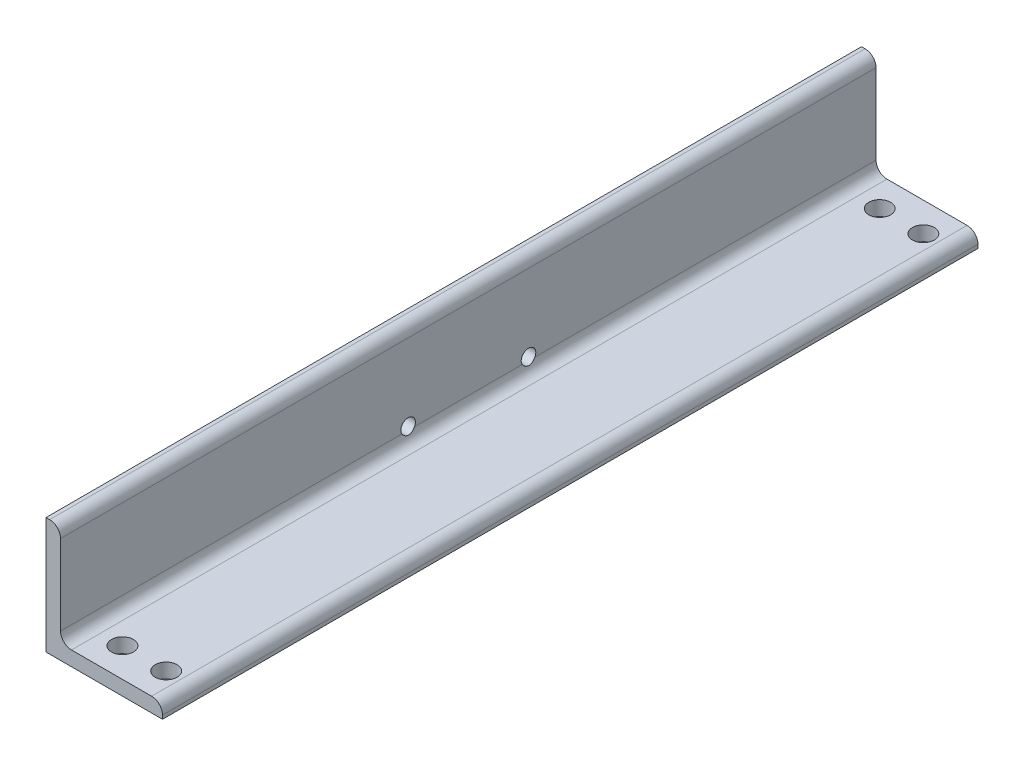
ISO-10303-21;
HEADER;
FILE_DESCRIPTION(('STEP AP214'),'2;1');
FILE_NAME('part.step','',(''),(''),'','','');
FILE_SCHEMA(('AUTOMOTIVE_DESIGN { 1 0 10303 214 1 1 1 1 }'));
ENDSEC;
DATA;
#1=APPLICATION_CONTEXT('core data for automotive mechanical design processes');
#2=APPLICATION_PROTOCOL_DEFINITION('international standard','automotive_design',2000,#1);
#3=PRODUCT_CONTEXT('',#1,'mechanical');
#4=PRODUCT('Part','Part','',(#3));
#5=PRODUCT_RELATED_PRODUCT_CATEGORY('part','',(#4));
#6=PRODUCT_DEFINITION_FORMATION('','',#4);
#7=PRODUCT_DEFINITION_CONTEXT('part definition',#1,'design');
#8=PRODUCT_DEFINITION('design','',#6,#7);
#9=PRODUCT_DEFINITION_SHAPE('','',#8);
#10=(LENGTH_UNIT() NAMED_UNIT(*) SI_UNIT(.MILLI.,.METRE.));
#11=(NAMED_UNIT(*) PLANE_ANGLE_UNIT() SI_UNIT($,.RADIAN.));
#12=(NAMED_UNIT(*) SI_UNIT($,.STERADIAN.) SOLID_ANGLE_UNIT());
#13=UNCERTAINTY_MEASURE_WITH_UNIT(LENGTH_MEASURE(1.E-05),#10,'distance_accuracy_value','');
#14=(GEOMETRIC_REPRESENTATION_CONTEXT(3) GLOBAL_UNCERTAINTY_ASSIGNED_CONTEXT((#13)) GLOBAL_UNIT_ASSIGNED_CONTEXT((#10,
#11,#12)) REPRESENTATION_CONTEXT('',''));
#15=CARTESIAN_POINT('',(0.,0.,0.));
#16=DIRECTION('',(0.,0.,1.));
#17=DIRECTION('',(1.,0.,0.));
#18=AXIS2_PLACEMENT_3D('',#15,#16,#17);
#19=CARTESIAN_POINT('',(101.6,0.,355.6));
#20=DIRECTION('',(0.,1.,0.));
#21=DIRECTION('',(-1.,0.,0.));
#22=AXIS2_PLACEMENT_3D('',#19,#20,#21);
#23=PLANE('',#22);
#24=CARTESIAN_POINT('',(79.3750000000002,0.,-330.2));
#25=DIRECTION('',(0.,1.,0.));
#26=DIRECTION('',(-1.,0.,0.));
#27=AXIS2_PLACEMENT_3D('',#24,#25,#26);
#28=CIRCLE('',#27,9.52500000000002);
#29=CARTESIAN_POINT('',(69.8500000000002,0.,-330.2));
#30=VERTEX_POINT('',#29);
#31=EDGE_CURVE('E211',#30,#30,#28,.F.);
#32=ORIENTED_EDGE('',*,*,#31,.F.);
#33=EDGE_LOOP('',(#32));
#34=FACE_BOUND('',#33,.T.);
#35=CARTESIAN_POINT('',(79.3750000000002,0.,330.2));
#36=DIRECTION('',(0.,1.,0.));
#37=DIRECTION('',(-1.,0.,0.));
#38=AXIS2_PLACEMENT_3D('',#35,#36,#37);
#39=CIRCLE('',#38,9.52500000000002);
#40=CARTESIAN_POINT('',(69.8500000000002,0.,330.2));
#41=VERTEX_POINT('',#40);
#42=EDGE_CURVE('E205',#41,#41,#39,.F.);
#43=ORIENTED_EDGE('',*,*,#42,.F.);
#44=EDGE_LOOP('',(#43));
#45=FACE_BOUND('',#44,.T.);
#46=CARTESIAN_POINT('',(41.275,0.,330.2));
#47=DIRECTION('',(0.,1.,0.));
#48=DIRECTION('',(-1.,0.,0.));
#49=AXIS2_PLACEMENT_3D('',#46,#47,#48);
#50=CIRCLE('',#49,9.52500000000002);
#51=CARTESIAN_POINT('',(31.75,0.,330.2));
#52=VERTEX_POINT('',#51);
#53=EDGE_CURVE('E199',#52,#52,#50,.F.);
#54=ORIENTED_EDGE('',*,*,#53,.F.);
#55=EDGE_LOOP('',(#54));
#56=FACE_BOUND('',#55,.T.);
#57=CARTESIAN_POINT('',(41.275,0.,-330.2));
#58=DIRECTION('',(0.,1.,0.));
#59=DIRECTION('',(-1.,0.,0.));
#60=AXIS2_PLACEMENT_3D('',#57,#58,#59);
#61=CIRCLE('',#60,9.52500000000002);
#62=CARTESIAN_POINT('',(31.75,0.,-330.2));
#63=VERTEX_POINT('',#62);
#64=EDGE_CURVE('E177',#63,#63,#61,.F.);
#65=ORIENTED_EDGE('',*,*,#64,.F.);
#66=EDGE_LOOP('',(#65));
#67=FACE_BOUND('',#66,.T.);
#68=DIRECTION('',(1.,0.,0.));
#69=VECTOR('',#68,1.);
#70=CARTESIAN_POINT('',(101.6,0.,-355.6));
#71=LINE('',#70,#69);
#72=CARTESIAN_POINT('',(0.,0.,-355.6));
#73=VERTEX_POINT('',#72);
#74=CARTESIAN_POINT('',(101.6,0.,-355.6));
#75=VERTEX_POINT('',#74);
#76=EDGE_CURVE('E174',#73,#75,#71,.T.);
#77=ORIENTED_EDGE('',*,*,#76,.T.);
#78=DIRECTION('',(0.,0.,-1.));
#79=VECTOR('',#78,1.);
#80=CARTESIAN_POINT('',(101.6,0.,355.6));
#81=LINE('',#80,#79);
#82=CARTESIAN_POINT('',(101.6,0.,355.6));
#83=VERTEX_POINT('',#82);
#84=EDGE_CURVE('E11',#83,#75,#81,.T.);
#85=ORIENTED_EDGE('',*,*,#84,.F.);
#86=DIRECTION('',(1.,0.,0.));
#87=VECTOR('',#86,1.);
#88=CARTESIAN_POINT('',(101.6,0.,355.6));
#89=LINE('',#88,#87);
#90=CARTESIAN_POINT('',(0.,0.,355.6));
#91=VERTEX_POINT('',#90);
#92=EDGE_CURVE('E159',#91,#83,#89,.T.);
#93=ORIENTED_EDGE('',*,*,#92,.F.);
#94=DIRECTION('',(0.,0.,-1.));
#95=VECTOR('',#94,1.);
#96=CARTESIAN_POINT('',(0.,0.,355.6));
#97=LINE('',#96,#95);
#98=EDGE_CURVE('E153',#91,#73,#97,.T.);
#99=ORIENTED_EDGE('',*,*,#98,.T.);
#100=EDGE_LOOP('',(#77,#85,#93,#99));
#101=FACE_BOUND('',#100,.T.);
#102=ADVANCED_FACE('F33',(#34,#45,#56,#67,#101),#23,.F.);
#103=CARTESIAN_POINT('',(101.6,3.18008,355.6));
#104=DIRECTION('',(-1.,0.,0.));
#105=DIRECTION('',(0.,0.,1.));
#106=AXIS2_PLACEMENT_3D('',#103,#104,#105);
#107=PLANE('',#106);
#108=DIRECTION('',(0.,1.,0.));
#109=VECTOR('',#108,1.);
#110=CARTESIAN_POINT('',(101.6,3.18008,-355.6));
#111=LINE('',#110,#109);
#112=CARTESIAN_POINT('',(101.6,3.18008,-355.6));
#113=VERTEX_POINT('',#112);
#114=EDGE_CURVE('E172',#75,#113,#111,.T.);
#115=ORIENTED_EDGE('',*,*,#114,.T.);
#116=DIRECTION('',(0.,0.,-1.));
#117=VECTOR('',#116,1.);
#118=CARTESIAN_POINT('',(101.6,3.18008,355.6));
#119=LINE('',#118,#117);
#120=CARTESIAN_POINT('',(101.6,3.18008,355.6));
#121=VERTEX_POINT('',#120);
#122=EDGE_CURVE('E40',#121,#113,#119,.T.);
#123=ORIENTED_EDGE('',*,*,#122,.F.);
#124=DIRECTION('',(0.,1.,0.));
#125=VECTOR('',#124,1.);
#126=CARTESIAN_POINT('',(101.6,3.18008,355.6));
#127=LINE('',#126,#125);
#128=EDGE_CURVE('E190',#83,#121,#127,.T.);
#129=ORIENTED_EDGE('',*,*,#128,.F.);
#130=ORIENTED_EDGE('',*,*,#84,.T.);
#131=EDGE_LOOP('',(#115,#123,#129,#130));
#132=FACE_BOUND('',#131,.T.);
#133=ADVANCED_FACE('F269',(#132),#107,.F.);
#134=CARTESIAN_POINT('',(92.08008,3.18008,355.6));
#135=DIRECTION('',(0.,0.,-1.));
#136=DIRECTION('',(-1.,0.,0.));
#137=AXIS2_PLACEMENT_3D('',#134,#135,#136);
#138=CYLINDRICAL_SURFACE('',#137,9.51991999999999);
#139=CARTESIAN_POINT('',(92.08008,3.18008,-355.6));
#140=DIRECTION('',(0.,0.,1.));
#141=DIRECTION('',(1.,0.,0.));
#142=AXIS2_PLACEMENT_3D('',#139,#140,#141);
#143=CIRCLE('',#142,9.51991999999999);
#144=CARTESIAN_POINT('',(92.08008,12.7,-355.6));
#145=VERTEX_POINT('',#144);
#146=EDGE_CURVE('E170',#113,#145,#143,.T.);
#147=ORIENTED_EDGE('',*,*,#146,.T.);
#148=DIRECTION('',(0.,0.,-1.));
#149=VECTOR('',#148,1.);
#150=CARTESIAN_POINT('',(92.08008,12.7,355.6));
#151=LINE('',#150,#149);
#152=CARTESIAN_POINT('',(92.08008,12.7,355.6));
#153=VERTEX_POINT('',#152);
#154=EDGE_CURVE('E136',#153,#145,#151,.T.);
#155=ORIENTED_EDGE('',*,*,#154,.F.);
#156=CARTESIAN_POINT('',(92.08008,3.18008,355.6));
#157=DIRECTION('',(0.,0.,1.));
#158=DIRECTION('',(1.,0.,0.));
#159=AXIS2_PLACEMENT_3D('',#156,#157,#158);
#160=CIRCLE('',#159,9.51991999999999);
#161=EDGE_CURVE('E188',#121,#153,#160,.T.);
#162=ORIENTED_EDGE('',*,*,#161,.F.);
#163=ORIENTED_EDGE('',*,*,#122,.T.);
#164=EDGE_LOOP('',(#147,#155,#162,#163));
#165=FACE_BOUND('',#164,.T.);
#166=ADVANCED_FACE('F265',(#165),#138,.T.);
#167=CARTESIAN_POINT('',(22.225,12.7,355.6));
#168=DIRECTION('',(0.,-1.,0.));
#169=DIRECTION('',(1.,0.,0.));
#170=AXIS2_PLACEMENT_3D('',#167,#168,#169);
#171=PLANE('',#170);
#172=CARTESIAN_POINT('',(79.3750000000002,12.7,-330.2));
#173=DIRECTION('',(0.,1.,0.));
#174=DIRECTION('',(1.,0.,0.));
#175=AXIS2_PLACEMENT_3D('',#172,#173,#174);
#176=CIRCLE('',#175,9.52500000000002);
#177=CARTESIAN_POINT('',(88.9000000000002,12.7,-330.2));
#178=VERTEX_POINT('',#177);
#179=EDGE_CURVE('E214',#178,#178,#176,.T.);
#180=ORIENTED_EDGE('',*,*,#179,.F.);
#181=EDGE_LOOP('',(#180));
#182=FACE_BOUND('',#181,.T.);
#183=CARTESIAN_POINT('',(79.3750000000002,12.7,330.2));
#184=DIRECTION('',(0.,1.,0.));
#185=DIRECTION('',(-1.,0.,0.));
#186=AXIS2_PLACEMENT_3D('',#183,#184,#185);
#187=CIRCLE('',#186,9.52500000000002);
#188=CARTESIAN_POINT('',(69.8500000000002,12.7,330.2));
#189=VERTEX_POINT('',#188);
#190=EDGE_CURVE('E208',#189,#189,#187,.T.);
#191=ORIENTED_EDGE('',*,*,#190,.F.);
#192=EDGE_LOOP('',(#191));
#193=FACE_BOUND('',#192,.T.);
#194=CARTESIAN_POINT('',(41.275,12.7,330.2));
#195=DIRECTION('',(0.,1.,0.));
#196=DIRECTION('',(1.,0.,0.));
#197=AXIS2_PLACEMENT_3D('',#194,#195,#196);
#198=CIRCLE('',#197,9.52500000000002);
#199=CARTESIAN_POINT('',(50.8,12.7,330.2));
#200=VERTEX_POINT('',#199);
#201=EDGE_CURVE('E202',#200,#200,#198,.T.);
#202=ORIENTED_EDGE('',*,*,#201,.F.);
#203=EDGE_LOOP('',(#202));
#204=FACE_BOUND('',#203,.T.);
#205=CARTESIAN_POINT('',(41.275,12.7,-330.2));
#206=DIRECTION('',(0.,1.,0.));
#207=DIRECTION('',(-1.,0.,0.));
#208=AXIS2_PLACEMENT_3D('',#205,#206,#207);
#209=CIRCLE('',#208,9.52500000000002);
#210=CARTESIAN_POINT('',(31.75,12.7,-330.2));
#211=VERTEX_POINT('',#210);
#212=EDGE_CURVE('E196',#211,#211,#209,.T.);
#213=ORIENTED_EDGE('',*,*,#212,.F.);
#214=EDGE_LOOP('',(#213));
#215=FACE_BOUND('',#214,.T.);
#216=DIRECTION('',(-1.,0.,0.));
#217=VECTOR('',#216,1.);
#218=CARTESIAN_POINT('',(22.225,12.7,-355.6));
#219=LINE('',#218,#217);
#220=CARTESIAN_POINT('',(22.225,12.7,-355.6));
#221=VERTEX_POINT('',#220);
#222=EDGE_CURVE('E168',#145,#221,#219,.T.);
#223=ORIENTED_EDGE('',*,*,#222,.T.);
#224=DIRECTION('',(0.,0.,-1.));
#225=VECTOR('',#224,1.);
#226=CARTESIAN_POINT('',(22.225,12.7,355.6));
#227=LINE('',#226,#225);
#228=CARTESIAN_POINT('',(22.225,12.7,355.6));
#229=VERTEX_POINT('',#228);
#230=EDGE_CURVE('E132',#229,#221,#227,.T.);
#231=ORIENTED_EDGE('',*,*,#230,.F.);
#232=DIRECTION('',(-1.,0.,0.));
#233=VECTOR('',#232,1.);
#234=CARTESIAN_POINT('',(22.225,12.7,355.6));
#235=LINE('',#234,#233);
#236=EDGE_CURVE('E186',#153,#229,#235,.T.);
#237=ORIENTED_EDGE('',*,*,#236,.F.);
#238=ORIENTED_EDGE('',*,*,#154,.T.);
#239=EDGE_LOOP('',(#223,#231,#237,#238));
#240=FACE_BOUND('',#239,.T.);
#241=ADVANCED_FACE('F261',(#182,#193,#204,#215,#240),#171,.F.);
#242=CARTESIAN_POINT('',(22.225,22.225,355.6));
#243=DIRECTION('',(0.,0.,-1.));
#244=DIRECTION('',(-1.,0.,0.));
#245=AXIS2_PLACEMENT_3D('',#242,#243,#244);
#246=CYLINDRICAL_SURFACE('',#245,9.525);
#247=DIRECTION('',(0.,0.,-1.));
#248=VECTOR('',#247,1.);
#249=CARTESIAN_POINT('',(12.7,22.225,355.6));
#250=LINE('',#249,#248);
#251=CARTESIAN_POINT('',(12.7,22.225,46.9898386859688));
#252=VERTEX_POINT('',#251);
#253=CARTESIAN_POINT('',(12.7,22.225,-46.9898386859688));
#254=VERTEX_POINT('',#253);
#255=EDGE_CURVE('E126',#252,#254,#250,.T.);
#256=ORIENTED_EDGE('',*,*,#255,.F.);
#257=CARTESIAN_POINT('',(12.7,22.225,57.9883613140312));
#258=CARTESIAN_POINT('',(12.6999827797198,22.073747023169,57.9010652201356));
#259=CARTESIAN_POINT('',(12.7036020266311,21.9261666695694,57.8075126623455));
#260=CARTESIAN_POINT('',(12.7169364482523,21.6394724254637,57.6087916880467));
#261=CARTESIAN_POINT('',(12.7266475791581,21.5003529857331,57.5036310151549));
#262=CARTESIAN_POINT('',(12.750958155591,21.2318706006449,57.2827790052491));
#263=CARTESIAN_POINT('',(12.7655439948094,21.1024817133119,57.1671176251949));
#264=CARTESIAN_POINT('',(12.798377928773,20.8538152379376,56.9258460242172));
#265=CARTESIAN_POINT('',(12.8166265898387,20.7345392175398,56.8002342666547));
#266=CARTESIAN_POINT('',(12.8554966806538,20.5070584428926,56.5401989781871));
#267=CARTESIAN_POINT('',(12.8761128381699,20.3988300647512,56.4057953030353));
#268=CARTESIAN_POINT('',(12.9185263814264,20.1937077958268,56.1287078060163));
#269=CARTESIAN_POINT('',(12.9403241689367,20.0968177960641,55.9860211666475));
#270=CARTESIAN_POINT('',(12.9839042072899,19.9149071167127,55.6931579148723));
#271=CARTESIAN_POINT('',(13.0056864428088,19.8298930504997,55.5429771918946));
#272=CARTESIAN_POINT('',(13.0480696077046,19.6723085952029,55.2360634666354));
#273=CARTESIAN_POINT('',(13.0686705459691,19.5997381124907,55.0793305136655));
#274=CARTESIAN_POINT('',(13.1084371762002,19.4647334353171,54.7534986760388));
#275=CARTESIAN_POINT('',(13.1275058271347,19.4028551354978,54.5841570080992));
#276=CARTESIAN_POINT('',(13.1621000716122,19.2936601731414,54.2405554814189));
#277=CARTESIAN_POINT('',(13.1776270141682,19.2463379638852,54.0662975237747));
#278=CARTESIAN_POINT('',(13.2042460989573,19.1666685130754,53.7141143642797));
#279=CARTESIAN_POINT('',(13.2153397547296,19.134316160165,53.5361904358563));
#280=CARTESIAN_POINT('',(13.2324460824723,19.0848905322721,53.1779933638632));
#281=CARTESIAN_POINT('',(13.2384590349304,19.0678164138286,52.9977203505364));
#282=CARTESIAN_POINT('',(13.2449047015103,19.0495315458891,52.6441047809365));
#283=CARTESIAN_POINT('',(13.2455676813632,19.0476661661744,52.4707999822138));
#284=CARTESIAN_POINT('',(13.2418817508243,19.0581020362111,52.1246741779014));
#285=CARTESIAN_POINT('',(13.2375329652902,19.0704029330389,51.9518531603668));
#286=CARTESIAN_POINT('',(13.2240617329295,19.1090488693273,51.6079804584642));
#287=CARTESIAN_POINT('',(13.2149392563347,19.1353939963659,51.4369287851363));
#288=CARTESIAN_POINT('',(13.1924145874921,19.2018799599007,51.097818829635));
#289=CARTESIAN_POINT('',(13.179012369901,19.2420208780908,50.9297605651938));
#290=CARTESIAN_POINT('',(13.1489414832537,19.3348245533895,50.6010485624637));
#291=CARTESIAN_POINT('',(13.1323423995837,19.3872249217998,50.4403141695282));
#292=CARTESIAN_POINT('',(13.09654646157,19.5045731325474,50.1237351278395));
#293=CARTESIAN_POINT('',(13.0773487466099,19.569525134804,49.9678921201718));
#294=CARTESIAN_POINT('',(13.0373033169677,19.7115759448712,49.6619466657816));
#295=CARTESIAN_POINT('',(13.0164545660346,19.7886824118256,49.5118479134289));
#296=CARTESIAN_POINT('',(12.9741618627834,19.9545503138604,49.218320601231));
#297=CARTESIAN_POINT('',(12.9527178920628,20.0433121096079,49.0748922479835));
#298=CARTESIAN_POINT('',(12.9091267176458,20.2373942526399,48.7875116740178));
#299=CARTESIAN_POINT('',(12.8870092961105,20.3433707692314,48.6439973630533));
#300=CARTESIAN_POINT('',(12.8446977357167,20.5671365603044,48.3662709902861));
#301=CARTESIAN_POINT('',(12.8245029073061,20.684921568229,48.2320555980954));
#302=CARTESIAN_POINT('',(12.7874276417262,20.9314165936433,47.9740092378239));
#303=CARTESIAN_POINT('',(12.770541517766,21.060107311767,47.8501606656117));
#304=CARTESIAN_POINT('',(12.7414041834692,21.3277095254071,47.613567490968));
#305=CARTESIAN_POINT('',(12.7291502409881,21.4666149381728,47.5008163721771));
#306=CARTESIAN_POINT('',(12.7134994081993,21.7085613726005,47.3208477880985));
#307=CARTESIAN_POINT('',(12.7085293033237,21.8091554322337,47.2504558963998));
#308=CARTESIAN_POINT('',(12.7017790449912,22.0142331751444,47.1156334058616));
#309=CARTESIAN_POINT('',(12.6999960275457,22.1187132800441,47.051197504272));
#310=CARTESIAN_POINT('',(12.7,22.225,46.9898386859688));
#311=B_SPLINE_CURVE_WITH_KNOTS('',3,(#257,#258,#259,#260,#261,#262,#263,#264,#265,#266,#267,
#268,#269,#270,#271,#272,#273,#274,#275,#276,#277,#278,#279,#280,#281,#282,#283,#284,#285,#286,
#287,#288,#289,#290,#291,#292,#293,#294,#295,#296,#297,#298,#299,#300,#301,#302,#303,#304,#305,
#306,#307,#308,#309,#310),.UNSPECIFIED.,.F.,.F.,(4,2,2,2,2,2,2,2,2,2,2,2,2,2,2,2,2,2,2,2,2,2,2,
2,2,2,4),(0.,0.523647527244092,1.04694782355641,1.56879951356916,2.09073195095308,
2.61152383605134,3.13249392175962,3.65375297441758,4.1750081048293,4.71822515052251,
5.26123494167947,5.80405918872552,6.34685346638262,6.86615386676676,7.38544133013571,
7.90473203175342,8.42402580848562,8.93308470454926,9.44231260546989,9.95186268900613,
10.4614285439838,11.0000966296267,11.5385707843629,12.0761111655917,12.6133339992296,
12.9817344318086,13.3498036447116),.UNSPECIFIED.);
#312=CARTESIAN_POINT('',(12.7,22.225,57.9883613140312));
#313=VERTEX_POINT('',#312);
#314=EDGE_CURVE('E46',#313,#252,#311,.T.);
#315=ORIENTED_EDGE('',*,*,#314,.F.);
#316=CARTESIAN_POINT('',(12.7,22.225,355.6));
#317=VERTEX_POINT('',#316);
#318=EDGE_CURVE('E124',#317,#313,#250,.T.);
#319=ORIENTED_EDGE('',*,*,#318,.F.);
#320=CARTESIAN_POINT('',(22.225,22.225,355.6));
#321=DIRECTION('',(0.,0.,-1.));
#322=DIRECTION('',(-1.,0.,0.));
#323=AXIS2_PLACEMENT_3D('',#320,#321,#322);
#324=CIRCLE('',#323,9.525);
#325=EDGE_CURVE('E184',#229,#317,#324,.T.);
#326=ORIENTED_EDGE('',*,*,#325,.F.);
#327=ORIENTED_EDGE('',*,*,#230,.T.);
#328=CARTESIAN_POINT('',(22.225,22.225,-355.6));
#329=DIRECTION('',(0.,0.,-1.));
#330=DIRECTION('',(-1.,0.,0.));
#331=AXIS2_PLACEMENT_3D('',#328,#329,#330);
#332=CIRCLE('',#331,9.525);
#333=CARTESIAN_POINT('',(12.7,22.225,-355.6));
#334=VERTEX_POINT('',#333);
#335=EDGE_CURVE('E166',#221,#334,#332,.T.);
#336=ORIENTED_EDGE('',*,*,#335,.T.);
#337=CARTESIAN_POINT('',(12.7,22.225,-57.9883613140312));
#338=VERTEX_POINT('',#337);
#339=EDGE_CURVE('E134',#338,#334,#250,.T.);
#340=ORIENTED_EDGE('',*,*,#339,.F.);
#341=CARTESIAN_POINT('',(12.7,22.225,-46.9898386859688));
#342=CARTESIAN_POINT('',(12.6999827797198,22.073747023169,-47.0771347798644));
#343=CARTESIAN_POINT('',(12.7036020266311,21.9261666695694,-47.1706873376545));
#344=CARTESIAN_POINT('',(12.7169364482523,21.6394724254637,-47.3694083119533));
#345=CARTESIAN_POINT('',(12.7266475791581,21.5003529857331,-47.4745689848451));
#346=CARTESIAN_POINT('',(12.750958155591,21.2318706006448,-47.6954209947508));
#347=CARTESIAN_POINT('',(12.7655439948094,21.1024817133119,-47.8110823748051));
#348=CARTESIAN_POINT('',(12.798377928773,20.8538152379376,-48.0523539757828));
#349=CARTESIAN_POINT('',(12.8166265898387,20.7345392175398,-48.1779657333453));
#350=CARTESIAN_POINT('',(12.8554966806538,20.5070584428925,-48.4380010218129));
#351=CARTESIAN_POINT('',(12.8761128381699,20.3988300647512,-48.5724046969646));
#352=CARTESIAN_POINT('',(12.9185263814264,20.1937077958268,-48.8494921939837));
#353=CARTESIAN_POINT('',(12.9403241689367,20.0968177960641,-48.9921788333524));
#354=CARTESIAN_POINT('',(12.9839042072899,19.9149071167127,-49.2850420851277));
#355=CARTESIAN_POINT('',(13.0056864428088,19.8298930504997,-49.4352228081054));
#356=CARTESIAN_POINT('',(13.0480696077046,19.6723085952029,-49.7421365333646));
#357=CARTESIAN_POINT('',(13.0686705459691,19.5997381124906,-49.8988694863345));
#358=CARTESIAN_POINT('',(13.1084371762002,19.4647334353171,-50.2247013239612));
#359=CARTESIAN_POINT('',(13.1275058271347,19.4028551354978,-50.3940429919008));
#360=CARTESIAN_POINT('',(13.1621000716123,19.2936601731414,-50.737644518581));
#361=CARTESIAN_POINT('',(13.1776270141682,19.2463379638851,-50.9119024762253));
#362=CARTESIAN_POINT('',(13.2042460989573,19.1666685130754,-51.2640856357203));
#363=CARTESIAN_POINT('',(13.2153397547297,19.134316160165,-51.4420095641437));
#364=CARTESIAN_POINT('',(13.2324460824723,19.0848905322721,-51.8002066361368));
#365=CARTESIAN_POINT('',(13.2384590349304,19.0678164138286,-51.9804796494636));
#366=CARTESIAN_POINT('',(13.2449047015103,19.0495315458891,-52.3340952190635));
#367=CARTESIAN_POINT('',(13.2455676813632,19.0476661661744,-52.5074000177862));
#368=CARTESIAN_POINT('',(13.2418817508243,19.0581020362111,-52.8535258220986));
#369=CARTESIAN_POINT('',(13.2375329652902,19.0704029330389,-53.0263468396332));
#370=CARTESIAN_POINT('',(13.2240617329295,19.1090488693273,-53.3702195415358));
#371=CARTESIAN_POINT('',(13.2149392563347,19.1353939963659,-53.5412712148637));
#372=CARTESIAN_POINT('',(13.1924145874921,19.2018799599007,-53.8803811703649));
#373=CARTESIAN_POINT('',(13.179012369901,19.2420208780907,-54.0484394348062));
#374=CARTESIAN_POINT('',(13.1489414832537,19.3348245533895,-54.3771514375363));
#375=CARTESIAN_POINT('',(13.1323423995837,19.3872249217998,-54.5378858304718));
#376=CARTESIAN_POINT('',(13.09654646157,19.5045731325473,-54.8544648721605));
#377=CARTESIAN_POINT('',(13.0773487466099,19.5695251348039,-55.0103078798282));
#378=CARTESIAN_POINT('',(13.0373033169677,19.7115759448712,-55.3162533342184));
#379=CARTESIAN_POINT('',(13.0164545660346,19.7886824118256,-55.4663520865711));
#380=CARTESIAN_POINT('',(12.9741618627834,19.9545503138604,-55.7598793987689));
#381=CARTESIAN_POINT('',(12.9527178920628,20.0433121096079,-55.9033077520165));
#382=CARTESIAN_POINT('',(12.9091267176458,20.2373942526399,-56.1906883259822));
#383=CARTESIAN_POINT('',(12.8870092961105,20.3433707692314,-56.3342026369467));
#384=CARTESIAN_POINT('',(12.8446977357167,20.5671365603044,-56.6119290097139));
#385=CARTESIAN_POINT('',(12.8245029073061,20.684921568229,-56.7461444019046));
#386=CARTESIAN_POINT('',(12.7874276417262,20.9314165936433,-57.0041907621761));
#387=CARTESIAN_POINT('',(12.770541517766,21.060107311767,-57.1280393343883));
#388=CARTESIAN_POINT('',(12.7414041834692,21.3277095254071,-57.364632509032));
#389=CARTESIAN_POINT('',(12.7291502409881,21.4666149381728,-57.4773836278229));
#390=CARTESIAN_POINT('',(12.7134994081993,21.7085613726005,-57.6573522119016));
#391=CARTESIAN_POINT('',(12.7085293033237,21.8091554322337,-57.7277441036002));
#392=CARTESIAN_POINT('',(12.7017790449912,22.0142331751444,-57.8625665941384));
#393=CARTESIAN_POINT('',(12.6999960275457,22.1187132800441,-57.927002495728));
#394=CARTESIAN_POINT('',(12.7,22.225,-57.9883613140312));
#395=B_SPLINE_CURVE_WITH_KNOTS('',3,(#341,#342,#343,#344,#345,#346,#347,#348,#349,#350,#351,
#352,#353,#354,#355,#356,#357,#358,#359,#360,#361,#362,#363,#364,#365,#366,#367,#368,#369,#370,
#371,#372,#373,#374,#375,#376,#377,#378,#379,#380,#381,#382,#383,#384,#385,#386,#387,#388,#389,
#390,#391,#392,#393,#394),.UNSPECIFIED.,.F.,.F.,(4,2,2,2,2,2,2,2,2,2,2,2,2,2,2,2,2,2,2,2,2,2,2,
2,2,2,4),(0.,0.523647527244094,1.04694782355641,1.56879951356915,2.09073195095308,
2.61152383605134,3.13249392175962,3.65375297441757,4.1750081048293,4.71822515052252,
5.26123494167948,5.80405918872553,6.34685346638263,6.86615386676677,7.38544133013572,
7.90473203175342,8.42402580848563,8.93308470454928,9.44231260546991,9.95186268900614,
10.4614285439838,11.0000966296267,11.5385707843629,12.0761111655918,12.6133339992296,
12.9817344318086,13.3498036447117),.UNSPECIFIED.);
#396=EDGE_CURVE('E53',#254,#338,#395,.T.);
#397=ORIENTED_EDGE('',*,*,#396,.F.);
#398=EDGE_LOOP('',(#256,#315,#319,#326,#327,#336,#340,#397));
#399=FACE_BOUND('',#398,.T.);
#400=ADVANCED_FACE('F122',(#399),#246,.F.);
#401=CARTESIAN_POINT('',(12.7,92.08008,355.6));
#402=DIRECTION('',(-1.,0.,0.));
#403=DIRECTION('',(0.,-1.,0.));
#404=AXIS2_PLACEMENT_3D('',#401,#402,#403);
#405=PLANE('',#404);
#406=ORIENTED_EDGE('',*,*,#318,.T.);
#407=CARTESIAN_POINT('',(12.7,25.4,52.4891));
#408=DIRECTION('',(-1.,0.,0.));
#409=DIRECTION('',(0.,-1.,0.));
#410=AXIS2_PLACEMENT_3D('',#407,#408,#409);
#411=CIRCLE('',#410,6.35);
#412=EDGE_CURVE('E113',#252,#313,#411,.F.);
#413=ORIENTED_EDGE('',*,*,#412,.F.);
#414=ORIENTED_EDGE('',*,*,#255,.T.);
#415=CARTESIAN_POINT('',(12.7,25.4,-52.4891));
#416=DIRECTION('',(-1.,0.,0.));
#417=DIRECTION('',(0.,-1.,0.));
#418=AXIS2_PLACEMENT_3D('',#415,#416,#417);
#419=CIRCLE('',#418,6.35);
#420=EDGE_CURVE('E223',#338,#254,#419,.F.);
#421=ORIENTED_EDGE('',*,*,#420,.F.);
#422=ORIENTED_EDGE('',*,*,#339,.T.);
#423=DIRECTION('',(0.,1.,0.));
#424=VECTOR('',#423,1.);
#425=CARTESIAN_POINT('',(12.7,92.08008,-355.6));
#426=LINE('',#425,#424);
#427=CARTESIAN_POINT('',(12.7,92.08008,-355.6));
#428=VERTEX_POINT('',#427);
#429=EDGE_CURVE('E164',#334,#428,#426,.T.);
#430=ORIENTED_EDGE('',*,*,#429,.T.);
#431=DIRECTION('',(0.,0.,-1.));
#432=VECTOR('',#431,1.);
#433=CARTESIAN_POINT('',(12.7,92.08008,355.6));
#434=LINE('',#433,#432);
#435=CARTESIAN_POINT('',(12.7,92.08008,355.6));
#436=VERTEX_POINT('',#435);
#437=EDGE_CURVE('E139',#436,#428,#434,.T.);
#438=ORIENTED_EDGE('',*,*,#437,.F.);
#439=DIRECTION('',(0.,1.,0.));
#440=VECTOR('',#439,1.);
#441=CARTESIAN_POINT('',(12.7,92.08008,355.6));
#442=LINE('',#441,#440);
#443=EDGE_CURVE('E131',#317,#436,#442,.T.);
#444=ORIENTED_EDGE('',*,*,#443,.F.);
#445=EDGE_LOOP('',(#406,#413,#414,#421,#422,#430,#438,#444));
#446=FACE_BOUND('',#445,.T.);
#447=ADVANCED_FACE('F129',(#446),#405,.F.);
#448=CARTESIAN_POINT('',(3.18008,92.08008,355.6));
#449=DIRECTION('',(0.,0.,-1.));
#450=DIRECTION('',(-1.,0.,0.));
#451=AXIS2_PLACEMENT_3D('',#448,#449,#450);
#452=CYLINDRICAL_SURFACE('',#451,9.51992);
#453=CARTESIAN_POINT('',(3.18008,92.08008,-355.6));
#454=DIRECTION('',(0.,0.,1.));
#455=DIRECTION('',(-1.,0.,0.));
#456=AXIS2_PLACEMENT_3D('',#453,#454,#455);
#457=CIRCLE('',#456,9.51992);
#458=CARTESIAN_POINT('',(3.18008,101.6,-355.6));
#459=VERTEX_POINT('',#458);
#460=EDGE_CURVE('E162',#428,#459,#457,.T.);
#461=ORIENTED_EDGE('',*,*,#460,.T.);
#462=DIRECTION('',(0.,0.,-1.));
#463=VECTOR('',#462,1.);
#464=CARTESIAN_POINT('',(3.18008,101.6,355.6));
#465=LINE('',#464,#463);
#466=CARTESIAN_POINT('',(3.18008,101.6,355.6));
#467=VERTEX_POINT('',#466);
#468=EDGE_CURVE('E143',#467,#459,#465,.T.);
#469=ORIENTED_EDGE('',*,*,#468,.F.);
#470=CARTESIAN_POINT('',(3.18008,92.08008,355.6));
#471=DIRECTION('',(0.,0.,1.));
#472=DIRECTION('',(-1.,0.,0.));
#473=AXIS2_PLACEMENT_3D('',#470,#471,#472);
#474=CIRCLE('',#473,9.51992);
#475=EDGE_CURVE('E181',#436,#467,#474,.T.);
#476=ORIENTED_EDGE('',*,*,#475,.F.);
#477=ORIENTED_EDGE('',*,*,#437,.T.);
#478=EDGE_LOOP('',(#461,#469,#476,#477));
#479=FACE_BOUND('',#478,.T.);
#480=ADVANCED_FACE('F251',(#479),#452,.T.);
#481=CARTESIAN_POINT('',(0.,101.6,355.6));
#482=DIRECTION('',(0.,-1.,0.));
#483=DIRECTION('',(0.,0.,-1.));
#484=AXIS2_PLACEMENT_3D('',#481,#482,#483);
#485=PLANE('',#484);
#486=DIRECTION('',(-1.,0.,0.));
#487=VECTOR('',#486,1.);
#488=CARTESIAN_POINT('',(0.,101.6,-355.6));
#489=LINE('',#488,#487);
#490=CARTESIAN_POINT('',(0.,101.6,-355.6));
#491=VERTEX_POINT('',#490);
#492=EDGE_CURVE('E160',#459,#491,#489,.T.);
#493=ORIENTED_EDGE('',*,*,#492,.T.);
#494=DIRECTION('',(0.,0.,-1.));
#495=VECTOR('',#494,1.);
#496=CARTESIAN_POINT('',(0.,101.6,355.6));
#497=LINE('',#496,#495);
#498=CARTESIAN_POINT('',(0.,101.6,355.6));
#499=VERTEX_POINT('',#498);
#500=EDGE_CURVE('E148',#499,#491,#497,.T.);
#501=ORIENTED_EDGE('',*,*,#500,.F.);
#502=DIRECTION('',(-1.,0.,0.));
#503=VECTOR('',#502,1.);
#504=CARTESIAN_POINT('',(0.,101.6,355.6));
#505=LINE('',#504,#503);
#506=EDGE_CURVE('E179',#467,#499,#505,.T.);
#507=ORIENTED_EDGE('',*,*,#506,.F.);
#508=ORIENTED_EDGE('',*,*,#468,.T.);
#509=EDGE_LOOP('',(#493,#501,#507,#508));
#510=FACE_BOUND('',#509,.T.);
#511=ADVANCED_FACE('F279',(#510),#485,.F.);
#512=CARTESIAN_POINT('',(0.,0.,355.6));
#513=DIRECTION('',(1.,0.,0.));
#514=DIRECTION('',(0.,0.,-1.));
#515=AXIS2_PLACEMENT_3D('',#512,#513,#514);
#516=PLANE('',#515);
#517=CARTESIAN_POINT('',(0.,25.4,52.4891));
#518=DIRECTION('',(-1.,0.,0.));
#519=DIRECTION('',(0.,0.,1.));
#520=AXIS2_PLACEMENT_3D('',#517,#518,#519);
#521=CIRCLE('',#520,6.35);
#522=CARTESIAN_POINT('',(0.,25.4,58.8391));
#523=VERTEX_POINT('',#522);
#524=EDGE_CURVE('E118',#523,#523,#521,.T.);
#525=ORIENTED_EDGE('',*,*,#524,.F.);
#526=EDGE_LOOP('',(#525));
#527=FACE_BOUND('',#526,.T.);
#528=CARTESIAN_POINT('',(0.,25.4,-52.4891));
#529=DIRECTION('',(-1.,0.,0.));
#530=DIRECTION('',(0.,0.,1.));
#531=AXIS2_PLACEMENT_3D('',#528,#529,#530);
#532=CIRCLE('',#531,6.35);
#533=CARTESIAN_POINT('',(0.,25.4,-46.1391));
#534=VERTEX_POINT('',#533);
#535=EDGE_CURVE('E127',#534,#534,#532,.T.);
#536=ORIENTED_EDGE('',*,*,#535,.F.);
#537=EDGE_LOOP('',(#536));
#538=FACE_BOUND('',#537,.T.);
#539=DIRECTION('',(0.,-1.,0.));
#540=VECTOR('',#539,1.);
#541=CARTESIAN_POINT('',(0.,0.,-355.6));
#542=LINE('',#541,#540);
#543=EDGE_CURVE('E157',#491,#73,#542,.T.);
#544=ORIENTED_EDGE('',*,*,#543,.T.);
#545=ORIENTED_EDGE('',*,*,#98,.F.);
#546=DIRECTION('',(0.,-1.,0.));
#547=VECTOR('',#546,1.);
#548=CARTESIAN_POINT('',(0.,0.,355.6));
#549=LINE('',#548,#547);
#550=EDGE_CURVE('E156',#499,#91,#549,.T.);
#551=ORIENTED_EDGE('',*,*,#550,.F.);
#552=ORIENTED_EDGE('',*,*,#500,.T.);
#553=EDGE_LOOP('',(#544,#545,#551,#552));
#554=FACE_BOUND('',#553,.T.);
#555=ADVANCED_FACE('F276',(#527,#538,#554),#516,.F.);
#556=CARTESIAN_POINT('',(3.18008,92.08008,355.6));
#557=DIRECTION('',(0.,0.,-1.));
#558=DIRECTION('',(-1.,0.,0.));
#559=AXIS2_PLACEMENT_3D('',#556,#557,#558);
#560=PLANE('',#559);
#561=ORIENTED_EDGE('',*,*,#92,.T.);
#562=ORIENTED_EDGE('',*,*,#128,.T.);
#563=ORIENTED_EDGE('',*,*,#161,.T.);
#564=ORIENTED_EDGE('',*,*,#236,.T.);
#565=ORIENTED_EDGE('',*,*,#325,.T.);
#566=ORIENTED_EDGE('',*,*,#443,.T.);
#567=ORIENTED_EDGE('',*,*,#475,.T.);
#568=ORIENTED_EDGE('',*,*,#506,.T.);
#569=ORIENTED_EDGE('',*,*,#550,.T.);
#570=EDGE_LOOP('',(#561,#562,#563,#564,#565,#566,#567,#568,#569));
#571=FACE_BOUND('',#570,.T.);
#572=ADVANCED_FACE('F254',(#571),#560,.F.);
#573=CARTESIAN_POINT('',(3.18008,92.08008,-355.6));
#574=DIRECTION('',(0.,0.,-1.));
#575=DIRECTION('',(-1.,0.,0.));
#576=AXIS2_PLACEMENT_3D('',#573,#574,#575);
#577=PLANE('',#576);
#578=ORIENTED_EDGE('',*,*,#76,.F.);
#579=ORIENTED_EDGE('',*,*,#543,.F.);
#580=ORIENTED_EDGE('',*,*,#492,.F.);
#581=ORIENTED_EDGE('',*,*,#460,.F.);
#582=ORIENTED_EDGE('',*,*,#429,.F.);
#583=ORIENTED_EDGE('',*,*,#335,.F.);
#584=ORIENTED_EDGE('',*,*,#222,.F.);
#585=ORIENTED_EDGE('',*,*,#146,.F.);
#586=ORIENTED_EDGE('',*,*,#114,.F.);
#587=EDGE_LOOP('',(#578,#579,#580,#581,#582,#583,#584,#585,#586));
#588=FACE_BOUND('',#587,.T.);
#589=ADVANCED_FACE('F248',(#588),#577,.T.);
#590=CARTESIAN_POINT('',(41.275,-0.000999999999999265,-330.2));
#591=DIRECTION('',(0.,1.,0.));
#592=DIRECTION('',(-1.,0.,0.));
#593=AXIS2_PLACEMENT_3D('',#590,#591,#592);
#594=CYLINDRICAL_SURFACE('',#593,9.52500000000002);
#595=ORIENTED_EDGE('',*,*,#212,.T.);
#596=EDGE_LOOP('',(#595));
#597=FACE_BOUND('',#596,.T.);
#598=ORIENTED_EDGE('',*,*,#64,.T.);
#599=EDGE_LOOP('',(#598));
#600=FACE_BOUND('',#599,.T.);
#601=ADVANCED_FACE('F302',(#597,#600),#594,.F.);
#602=CARTESIAN_POINT('',(41.275,-0.000999999999999265,330.2));
#603=DIRECTION('',(0.,1.,0.));
#604=DIRECTION('',(-1.,0.,0.));
#605=AXIS2_PLACEMENT_3D('',#602,#603,#604);
#606=CYLINDRICAL_SURFACE('',#605,9.52500000000002);
#607=ORIENTED_EDGE('',*,*,#201,.T.);
#608=EDGE_LOOP('',(#607));
#609=FACE_BOUND('',#608,.T.);
#610=ORIENTED_EDGE('',*,*,#53,.T.);
#611=EDGE_LOOP('',(#610));
#612=FACE_BOUND('',#611,.T.);
#613=ADVANCED_FACE('F304',(#609,#612),#606,.F.);
#614=CARTESIAN_POINT('',(79.3750000000002,-0.001000000000001,330.2));
#615=DIRECTION('',(0.,1.,0.));
#616=DIRECTION('',(-1.,0.,0.));
#617=AXIS2_PLACEMENT_3D('',#614,#615,#616);
#618=CYLINDRICAL_SURFACE('',#617,9.52500000000002);
#619=ORIENTED_EDGE('',*,*,#190,.T.);
#620=EDGE_LOOP('',(#619));
#621=FACE_BOUND('',#620,.T.);
#622=ORIENTED_EDGE('',*,*,#42,.T.);
#623=EDGE_LOOP('',(#622));
#624=FACE_BOUND('',#623,.T.);
#625=ADVANCED_FACE('F311',(#621,#624),#618,.F.);
#626=CARTESIAN_POINT('',(79.3750000000002,-0.001000000000001,-330.2));
#627=DIRECTION('',(0.,1.,0.));
#628=DIRECTION('',(-1.,0.,0.));
#629=AXIS2_PLACEMENT_3D('',#626,#627,#628);
#630=CYLINDRICAL_SURFACE('',#629,9.52500000000002);
#631=ORIENTED_EDGE('',*,*,#179,.T.);
#632=EDGE_LOOP('',(#631));
#633=FACE_BOUND('',#632,.T.);
#634=ORIENTED_EDGE('',*,*,#31,.T.);
#635=EDGE_LOOP('',(#634));
#636=FACE_BOUND('',#635,.T.);
#637=ADVANCED_FACE('F363',(#633,#636),#630,.F.);
#638=CARTESIAN_POINT('',(101.601,25.4,-52.4891));
#639=DIRECTION('',(-1.,0.,0.));
#640=DIRECTION('',(0.,0.,1.));
#641=AXIS2_PLACEMENT_3D('',#638,#639,#640);
#642=CYLINDRICAL_SURFACE('',#641,6.35);
#643=ORIENTED_EDGE('',*,*,#535,.T.);
#644=EDGE_LOOP('',(#643));
#645=FACE_BOUND('',#644,.T.);
#646=ORIENTED_EDGE('',*,*,#396,.T.);
#647=ORIENTED_EDGE('',*,*,#420,.T.);
#648=EDGE_LOOP('',(#646,#647));
#649=FACE_BOUND('',#648,.T.);
#650=ADVANCED_FACE('F225',(#645,#649),#642,.F.);
#651=CARTESIAN_POINT('',(101.601,25.4,52.4891));
#652=DIRECTION('',(-1.,0.,0.));
#653=DIRECTION('',(0.,0.,1.));
#654=AXIS2_PLACEMENT_3D('',#651,#652,#653);
#655=CYLINDRICAL_SURFACE('',#654,6.35);
#656=ORIENTED_EDGE('',*,*,#524,.T.);
#657=EDGE_LOOP('',(#656));
#658=FACE_BOUND('',#657,.T.);
#659=ORIENTED_EDGE('',*,*,#314,.T.);
#660=ORIENTED_EDGE('',*,*,#412,.T.);
#661=EDGE_LOOP('',(#659,#660));
#662=FACE_BOUND('',#661,.T.);
#663=ADVANCED_FACE('F114',(#658,#662),#655,.F.);
#664=CLOSED_SHELL('',(#102,#133,#166,#241,#400,#447,#480,#511,#555,#572,#589,#601,#613,#625,
#637,#650,#663));
#665=MANIFOLD_SOLID_BREP('B2',#664);
#666=ADVANCED_BREP_SHAPE_REPRESENTATION('',(#18,#665),#14);
#667=SHAPE_DEFINITION_REPRESENTATION(#9,#666);
ENDSEC;
END-ISO-10303-21;
